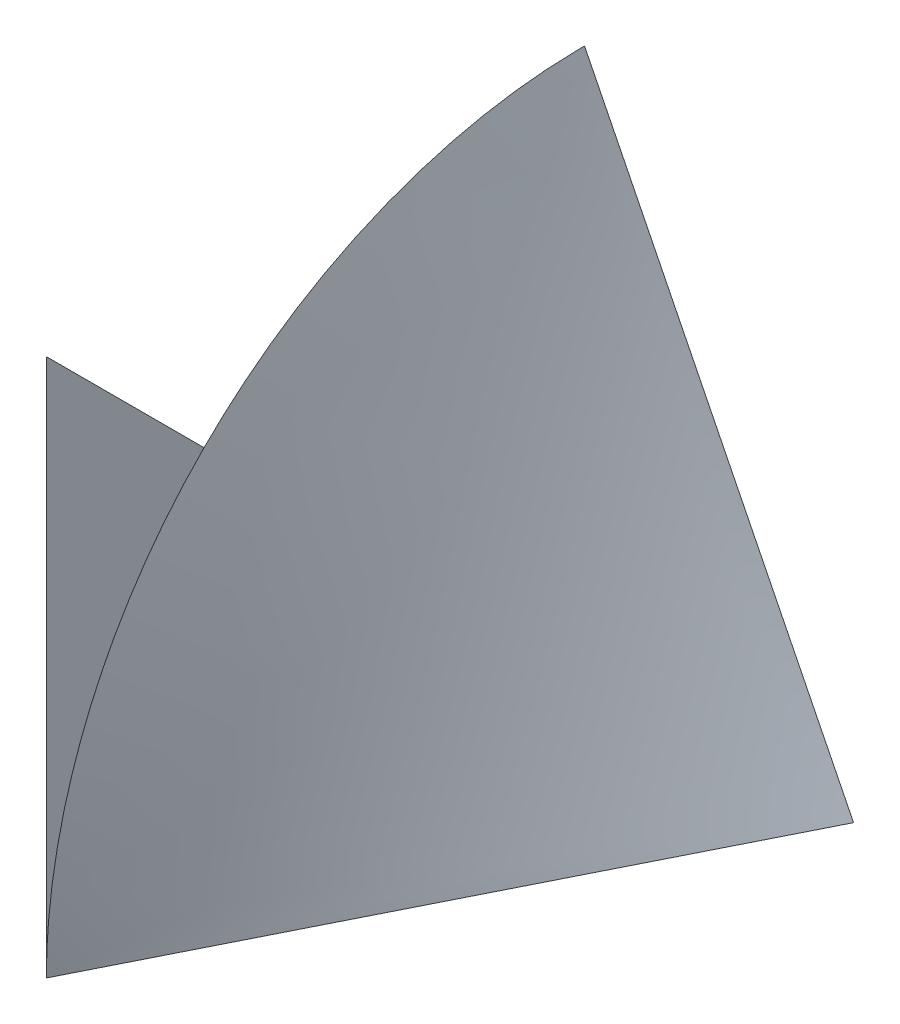
ISO-10303-21;
HEADER;
FILE_DESCRIPTION(('STEP AP214'),'2;1');
FILE_NAME('part.step','',(''),(''),'','','');
FILE_SCHEMA(('AUTOMOTIVE_DESIGN { 1 0 10303 214 1 1 1 1 }'));
ENDSEC;
DATA;
#1=APPLICATION_CONTEXT('core data for automotive mechanical design processes');
#2=APPLICATION_PROTOCOL_DEFINITION('international standard','automotive_design',2000,#1);
#3=PRODUCT_CONTEXT('',#1,'mechanical');
#4=PRODUCT('Part','Part','',(#3));
#5=PRODUCT_RELATED_PRODUCT_CATEGORY('part','',(#4));
#6=PRODUCT_DEFINITION_FORMATION('','',#4);
#7=PRODUCT_DEFINITION_CONTEXT('part definition',#1,'design');
#8=PRODUCT_DEFINITION('design','',#6,#7);
#9=PRODUCT_DEFINITION_SHAPE('','',#8);
#10=(LENGTH_UNIT() NAMED_UNIT(*) SI_UNIT(.MILLI.,.METRE.));
#11=(NAMED_UNIT(*) PLANE_ANGLE_UNIT() SI_UNIT($,.RADIAN.));
#12=(NAMED_UNIT(*) SI_UNIT($,.STERADIAN.) SOLID_ANGLE_UNIT());
#13=UNCERTAINTY_MEASURE_WITH_UNIT(LENGTH_MEASURE(1.E-05),#10,'distance_accuracy_value','');
#14=(GEOMETRIC_REPRESENTATION_CONTEXT(3) GLOBAL_UNCERTAINTY_ASSIGNED_CONTEXT((#13)) GLOBAL_UNIT_ASSIGNED_CONTEXT((#10,
#11,#12)) REPRESENTATION_CONTEXT('',''));
#15=CARTESIAN_POINT('',(0.,0.,0.));
#16=DIRECTION('',(0.,0.,1.));
#17=DIRECTION('',(1.,0.,0.));
#18=AXIS2_PLACEMENT_3D('',#15,#16,#17);
#19=CARTESIAN_POINT('',(0.,0.,0.));
#20=DIRECTION('',(0.,-1.,0.));
#21=DIRECTION('',(0.,0.,-1.));
#22=AXIS2_PLACEMENT_3D('',#19,#20,#21);
#23=PLANE('',#22);
#24=DIRECTION('',(0.447188418671129,0.,0.894439778971405));
#25=VECTOR('',#24,1.);
#26=CARTESIAN_POINT('',(-1.39406305274967E-05,0.,2.));
#27=LINE('',#26,#25);
#28=CARTESIAN_POINT('',(-1.99987335916185,-9.28745872898386E-06,-2.00000031664622));
#29=VERTEX_POINT('',#28);
#30=CARTESIAN_POINT('',(-3.56157288495491E-05,6.97657941034187E-05,2.00006976573752));
#31=VERTEX_POINT('',#30);
#32=EDGE_CURVE('E208',#29,#31,#27,.T.);
#33=ORIENTED_EDGE('',*,*,#32,.F.);
#34=CARTESIAN_POINT('',(0.000103609245025085,0.,-1.99999102927233));
#35=DIRECTION('',(-1.,0.,0.));
#36=VECTOR('',#35,1.);
#37=LINE('',#34,#36);
#38=CARTESIAN_POINT('',(0.000103609245025085,-5.22420083752249E-06,-1.99999625342544));
#39=VERTEX_POINT('',#38);
#40=EDGE_CURVE('E111',#39,#29,#37,.T.);
#41=ORIENTED_EDGE('',*,*,#40,.F.);
#42=DIRECTION('',(-1.,0.,0.));
#43=VECTOR('',#42,1.);
#44=CARTESIAN_POINT('',(-2.,0.,-2.));
#45=LINE('',#44,#43);
#46=CARTESIAN_POINT('',(1.99989168434998,-8.3713605003607E-06,-2.0000083713605));
#47=VERTEX_POINT('',#46);
#48=EDGE_CURVE('E59',#47,#39,#45,.T.);
#49=ORIENTED_EDGE('',*,*,#48,.F.);
#50=CARTESIAN_POINT('',(0.000875798366615509,0.000279063176195504,2.00027906272354));
#51=CARTESIAN_POINT('',(0.0837069902664033,0.000114321391326568,1.83341790211676));
#52=CARTESIAN_POINT('',(0.166760266654798,2.5824815957855E-05,1.66666738616965));
#53=CARTESIAN_POINT('',(0.333150650163644,-6.07299361798723E-05,1.33325678604981));
#54=CARTESIAN_POINT('',(0.416487821975475,-5.87658988175555E-05,1.16659673413993));
#55=CARTESIAN_POINT('',(0.5832516993621,-2.6430144579629E-05,0.833304277000826));
#56=CARTESIAN_POINT('',(0.66667841177579,3.94392325566219E-06,0.666671875201032));
#57=CARTESIAN_POINT('',(0.833462796655206,4.21516981306896E-05,0.333381132018225));
#58=CARTESIAN_POINT('',(0.91682047184071,4.99863399270686E-05,0.166722791997599));
#59=CARTESIAN_POINT('',(1.08344561174981,3.64771559339593E-05,-0.166625790121181));
#60=CARTESIAN_POINT('',(1.16671308184419,1.51351750872063E-05,-0.333316029535826));
#61=CARTESIAN_POINT('',(1.33324950456927,-2.7255169058637E-05,-0.666697336870446));
#62=CARTESIAN_POINT('',(1.41651845720639,-4.83035301613499E-05,-0.833388404787299));
#63=CARTESIAN_POINT('',(1.58319168850622,-4.59503601463192E-05,-1.16671774407098));
#64=CARTESIAN_POINT('',(1.66659597640317,-2.25456564726301E-05,-1.33335601082054));
#65=CARTESIAN_POINT('',(1.8333375242331,2.90581819594307E-06,-1.66665390369432));
#66=CARTESIAN_POINT('',(1.91667478779334,4.95383540343697E-06,-1.83331352800475));
#67=CARTESIAN_POINT('',(1.99988521040192,-3.65764076934509E-05,-2.00003657640769));
#68=B_SPLINE_CURVE_WITH_KNOTS('',3,(#50,#51,#52,#53,#54,#55,#56,#57,#58,#59,#60,#61,#62,#63,#64,
#65,#66,#67),.UNSPECIFIED.,.F.,.F.,(4,2,2,2,2,2,2,2,4),(0.,0.558866956671007,1.117871153294,
1.67692161219078,2.23594888577383,2.79494081168776,3.35393691681514,3.91297291824808,
4.47197629844018),.UNSPECIFIED.);
#69=EDGE_CURVE('E67',#47,#31,#68,.F.);
#70=ORIENTED_EDGE('',*,*,#69,.T.);
#71=EDGE_LOOP('',(#33,#41,#49,#70));
#72=FACE_BOUND('',#71,.T.);
#73=ADVANCED_FACE('F47',(#72),#23,.T.);
#74=CARTESIAN_POINT('',(0.000103609245025085,-9.28745872898386E-06,-2.00000031664622));
#75=DIRECTION('',(0.,-0.707103551547574,0.70711001081077));
#76=DIRECTION('',(0.,-0.70711001081077,-0.707103551547574));
#77=AXIS2_PLACEMENT_3D('',#74,#75,#76);
#78=PLANE('',#77);
#79=ORIENTED_EDGE('',*,*,#40,.T.);
#80=DIRECTION('',(0.333311129509906,0.666675262358807,0.666669172456359));
#81=VECTOR('',#80,1.);
#82=CARTESIAN_POINT('',(-1.7776832997765,0.444406164110659,-1.5555889246946));
#83=LINE('',#82,#81);
#84=CARTESIAN_POINT('',(-1.39406305274967E-05,4.00002756846773,2.));
#85=VERTEX_POINT('',#84);
#86=EDGE_CURVE('E12',#29,#85,#83,.T.);
#87=ORIENTED_EDGE('',*,*,#86,.T.);
#88=DIRECTION('',(0.,-0.70711001081077,-0.707103551547574));
#89=VECTOR('',#88,1.);
#90=CARTESIAN_POINT('',(-1.39406305274967E-05,1.99999087078094,-1.84278797841879E-05));
#91=LINE('',#90,#89);
#92=CARTESIAN_POINT('',(-0.000102407863481279,2.82818444233477,0.828167515466161));
#93=VERTEX_POINT('',#92);
#94=EDGE_CURVE('E105',#85,#93,#91,.T.);
#95=ORIENTED_EDGE('',*,*,#94,.T.);
#96=DIRECTION('',(0.,0.70711001081077,0.707103551547574));
#97=VECTOR('',#96,1.);
#98=CARTESIAN_POINT('',(0.000103609245025085,-9.28745872898386E-06,-2.00000031664622));
#99=LINE('',#98,#97);
#100=EDGE_CURVE('E92',#39,#93,#99,.T.);
#101=ORIENTED_EDGE('',*,*,#100,.F.);
#102=EDGE_LOOP('',(#79,#87,#95,#101));
#103=FACE_BOUND('',#102,.T.);
#104=ADVANCED_FACE('F106',(#103),#78,.F.);
#105=CARTESIAN_POINT('',(-2.,4.,-2.));
#106=DIRECTION('',(0.,0.,1.));
#107=DIRECTION('',(1.,0.,0.));
#108=AXIS2_PLACEMENT_3D('',#105,#106,#107);
#109=PLANE('',#108);
#110=ORIENTED_EDGE('',*,*,#48,.T.);
#111=DIRECTION('',(0.,-0.999999999999997,-7.91608245531659E-08));
#112=VECTOR('',#111,1.);
#113=CARTESIAN_POINT('',(0.000103609245025085,4.00002756846773,-2.));
#114=LINE('',#113,#112);
#115=CARTESIAN_POINT('',(-1.39406305274967E-05,4.00002756846773,-1.99997243153227));
#116=VERTEX_POINT('',#115);
#117=EDGE_CURVE('E115',#116,#39,#114,.T.);
#118=ORIENTED_EDGE('',*,*,#117,.F.);
#119=CARTESIAN_POINT('',(1.99988521040192,-3.65764076902739E-05,-2.00003657640769));
#120=CARTESIAN_POINT('',(1.91654485122619,0.166627903865693,-2.00003880792397));
#121=CARTESIAN_POINT('',(1.83320103399918,0.333290657306252,-2.0000422271948));
#122=CARTESIAN_POINT('',(1.66652639514234,0.666620305131661,-2.00004492483027));
#123=CARTESIAN_POINT('',(1.58319557337616,0.833287199448332,-2.00004420324175));
#124=CARTESIAN_POINT('',(1.41656681786021,1.16663275869716,-2.0000321032242));
#125=CARTESIAN_POINT('',(1.33326888341521,1.33331142328179,-2.000020725034));
#126=CARTESIAN_POINT('',(1.16668077614414,1.66667133956219,-1.99999547984068));
#127=CARTESIAN_POINT('',(1.0833906032732,1.83335259123553,-1.99998161285297));
#128=CARTESIAN_POINT('',(0.916788519100106,2.16670770044612,-1.99996086981952));
#129=CARTESIAN_POINT('',(0.833476607459166,2.3333815578141,-1.99995399389016));
#130=CARTESIAN_POINT('',(0.666818288562755,2.66671732680947,-1.99995136478653));
#131=CARTESIAN_POINT('',(0.583471880483026,2.83337923802468,-1.99995561189546));
#132=CARTESIAN_POINT('',(0.416766179249375,3.16669651780215,-1.99996854669685));
#133=CARTESIAN_POINT('',(0.333406886102092,3.33335188636771,-1.99997723438705));
#134=CARTESIAN_POINT('',(0.166782488533559,3.66669263770975,-1.99996459731462));
#135=CARTESIAN_POINT('',(0.0835173769603532,3.83337801691231,-1.99994327500886));
#136=CARTESIAN_POINT('',(0.000346078090228706,4.00011027387091,-1.99988972612908));
#137=B_SPLINE_CURVE_WITH_KNOTS('',3,(#119,#120,#121,#122,#123,#124,#125,#126,#127,#128,#129,
#130,#131,#132,#133,#134,#135,#136),.UNSPECIFIED.,.F.,.F.,(4,2,2,2,2,2,2,2,4),(0.,
0.559020558287219,1.11803479226773,1.67703649758111,2.23603474063693,2.79504228889593,
3.35406406956563,3.91308556318331,4.47206129348129),.UNSPECIFIED.);
#138=EDGE_CURVE('E194',#116,#47,#137,.F.);
#139=ORIENTED_EDGE('',*,*,#138,.T.);
#140=EDGE_LOOP('',(#110,#118,#139));
#141=FACE_BOUND('',#140,.T.);
#142=ADVANCED_FACE('F49',(#141),#109,.F.);
#143=CARTESIAN_POINT('',(-0.0223445822368762,4.04551000308371,-2.05013568896862));
#144=CARTESIAN_POINT('',(0.389245917586985,3.22979955401737,-2.04815105747686));
#145=CARTESIAN_POINT('',(0.80376631841207,2.41502268478151,-2.04523284615462));
#146=CARTESIAN_POINT('',(1.2138327944319,1.59882662275964,-2.0437338276184));
#147=CARTESIAN_POINT('',(1.62547477029438,0.783132575951057,-2.04173279386888));
#148=CARTESIAN_POINT('',(2.0363210381082,-0.0328150142314784,-2.03998530349331));
#149=CARTESIAN_POINT('',(-0.00157645550172039,4.01078979222863,-1.12088691832415));
#150=CARTESIAN_POINT('',(0.330782508042385,3.1698331098672,-1.14414852012748));
#151=CARTESIAN_POINT('',(0.661463515093786,2.32834176563927,-1.16794478379732));
#152=CARTESIAN_POINT('',(0.998024508618965,1.48872401262588,-1.1898674562526));
#153=CARTESIAN_POINT('',(1.3496576785027,0.65390883821288,-1.20698755010751));
#154=CARTESIAN_POINT('',(1.70166608078987,-0.180786772636899,-1.22398808039919));
#155=CARTESIAN_POINT('',(-0.0801410042412669,3.94441834732446,-0.223289381728774));
#156=CARTESIAN_POINT('',(0.212645880851122,3.09085246954069,-0.259160178954445));
#157=CARTESIAN_POINT('',(0.487497486294741,2.23157171766153,-0.3007458502755));
#158=CARTESIAN_POINT('',(0.76296722670346,1.37248792750071,-0.342134559878237));
#159=CARTESIAN_POINT('',(1.0370474490773,0.512961383127122,-0.383966023693716));
#160=CARTESIAN_POINT('',(1.33318970498991,-0.339535343678444,-0.418767669941185));
#161=CARTESIAN_POINT('',(-0.225399102421753,3.85679575688504,0.653057009331347));
#162=CARTESIAN_POINT('',(0.0687644817012423,3.00366854868332,0.617624881687722));
#163=CARTESIAN_POINT('',(0.316590909279943,2.13577652940659,0.567427942969095));
#164=CARTESIAN_POINT('',(0.464826169582532,1.23615091059074,0.485497404711355));
#165=CARTESIAN_POINT('',(0.713655116844502,0.368578332877242,0.435619907555955));
#166=CARTESIAN_POINT('',(0.961196515742705,-0.499404507566119,0.385332147670681));
#167=CARTESIAN_POINT('',(-0.42444655194897,3.75203379774657,1.51226403169242));
#168=CARTESIAN_POINT('',(-0.154207559267555,2.8912832889579,1.46920860346185));
#169=CARTESIAN_POINT('',(0.0680055397752079,2.01522987211099,1.41085026717304));
#170=CARTESIAN_POINT('',(0.208824710855955,1.11324120030595,1.32655667592612));
#171=CARTESIAN_POINT('',(0.366742160711515,0.216700701730546,1.2477112579088));
#172=CARTESIAN_POINT('',(0.522343418228537,-0.680577825348242,1.1681278113881));
#173=CARTESIAN_POINT('',(-0.662558095217739,3.6348245067707,2.35902372221611));
#174=CARTESIAN_POINT('',(-0.408614144013187,2.76888176723662,2.31077606324013));
#175=CARTESIAN_POINT('',(-0.203038330924701,1.88752706731073,2.24711644387233));
#176=CARTESIAN_POINT('',(-0.0425084820645144,0.991818980144022,2.16910343726371));
#177=CARTESIAN_POINT('',(-0.0322366133536195,0.048232886322163,2.04321242399998));
#178=CARTESIAN_POINT('',(0.0386648782400475,-0.876034263607353,1.93664035462853));
#179=B_SPLINE_SURFACE_WITH_KNOTS('',5,5,((#143,#144,#145,#146,#147,#148),(#149,#150,#151,#152,
#153,#154),(#155,#156,#157,#158,#159,#160),(#161,#162,#163,#164,#165,#166),(#167,#168,#169,#170,
#171,#172),(#173,#174,#175,#176,#177,#178)),.UNSPECIFIED.,.F.,.F.,.F.,(6,6),(6,6),
(-1.64494672878529,2.79186118228678),(-2.54970046226169,1.96558601863418),.UNSPECIFIED.);
#180=CARTESIAN_POINT('',(0.000346078090228502,4.00011027387092,-1.99988972612909));
#181=CARTESIAN_POINT('',(0.000340741411696202,4.00010857405014,-1.99897851564378));
#182=CARTESIAN_POINT('',(0.000335437691624804,4.00010657119289,-1.99806730553074));
#183=CARTESIAN_POINT('',(0.000324895936222993,4.00010195943391,-1.99624492105267));
#184=CARTESIAN_POINT('',(0.000319657898406586,4.0000993505552,-1.99533374668759));
#185=CARTESIAN_POINT('',(0.000309247068695348,4.00009352676374,-1.99351143426773));
#186=CARTESIAN_POINT('',(0.000304074274320183,4.00009031187411,-1.99260029621289));
#187=CARTESIAN_POINT('',(0.00029379349458493,4.00008327607177,-1.99077805697498));
#188=CARTESIAN_POINT('',(0.000288685506750293,4.00007945518227,-1.98986695579183));
#189=CARTESIAN_POINT('',(0.000278533904599104,4.00007120739162,-1.98804479085794));
#190=CARTESIAN_POINT('',(0.00027349028781393,4.00006678051379,-1.98713372710711));
#191=CARTESIAN_POINT('',(0.000263466993815141,4.00005732075837,-1.98531163759767));
#192=CARTESIAN_POINT('',(0.000258487314138966,4.00005228790421,-1.98440061183894));
#193=CARTESIAN_POINT('',(0.000248591461917345,4.00004161620854,-1.9825785988727));
#194=CARTESIAN_POINT('',(0.000243675286915538,4.00003597739054,-1.98166761166505));
#195=CARTESIAN_POINT('',(0.000233906013124367,4.00002409378007,-1.97984567635912));
#196=CARTESIAN_POINT('',(0.000229052911884976,4.00001784901121,-1.97893472826069));
#197=CARTESIAN_POINT('',(0.000219409356213384,4.00000475351239,-1.97711287173051));
#198=CARTESIAN_POINT('',(0.00021461889933762,3.99999790280614,-1.97620196329861));
#199=CARTESIAN_POINT('',(0.000205100204507336,3.99998359544635,-1.97438018665798));
#200=CARTESIAN_POINT('',(0.000200371964115848,3.99997613881663,-1.97346931844909));
#201=CARTESIAN_POINT('',(0.000190977275881993,3.99996061962424,-1.97164762281017));
#202=CARTESIAN_POINT('',(0.000186310825609382,3.99995255708549,-1.97073679537994));
#203=CARTESIAN_POINT('',(0.000177039292757789,3.99993582608984,-1.96891518185321));
#204=CARTESIAN_POINT('',(0.000172434207755413,3.99992715765696,-1.96800439575649));
#205=CARTESIAN_POINT('',(0.000163284982099039,3.99990921488834,-1.96618286545078));
#206=CARTESIAN_POINT('',(0.000158740839028621,3.99989994057671,-1.96527212124157));
#207=CARTESIAN_POINT('',(0.000149713075430851,3.99988078606639,-1.96345067526409));
#208=CARTESIAN_POINT('',(0.000145229452494175,3.99987090589189,-1.96253997349557));
#209=CARTESIAN_POINT('',(0.000136322308768512,3.99985053967208,-1.96071861295185));
#210=CARTESIAN_POINT('',(0.000131898785577424,3.99984005365108,-1.95980795417639));
#211=CARTESIAN_POINT('',(0.000123111422852146,3.99981847575501,-1.95798668017033));
#212=CARTESIAN_POINT('',(0.000118747580923181,3.99980738390434,-1.95707606493946));
#213=CARTESIAN_POINT('',(0.000114413284051044,3.99979598890504,-1.95616545336141));
#214=B_SPLINE_CURVE_WITH_KNOTS('',3,(#180,#181,#182,#183,#184,#185,#186,#187,#188,#189,#190,
#191,#192,#193,#194,#195,#196,#197,#198,#199,#200,#201,#202,#203,#204,#205,#206,#207,#208,#209,
#210,#211,#212,#213),.UNSPECIFIED.,.F.,.F.,(4,2,2,2,2,2,2,2,2,2,2,2,2,2,2,2,4),(0.,
0.00273368304377199,0.00546726230673018,0.00820073733311294,0.0109341076694122,
0.0136673728643797,0.0164005324690386,0.0191335860366666,0.0218665331228122,0.0245993732852783,
0.0273321060841429,0.0300647310817479,0.0327972478426922,0.0355296559338529,0.0382619549243627,
0.0409941443856234,0.0437262238913072),.UNSPECIFIED.);
#215=CARTESIAN_POINT('',(0.000103609245025085,4.00002756846773,-1.96047909161518));
#216=VERTEX_POINT('',#215);
#217=EDGE_CURVE('E122',#216,#116,#214,.F.);
#218=CARTESIAN_POINT('',(0.000114413284051044,3.99979598890504,-1.95616545336141));
#219=CARTESIAN_POINT('',(-4.25894540195342E-05,3.99938212161447,-1.92308708573734));
#220=CARTESIAN_POINT('',(-0.000161477371957222,3.99856812212523,-1.89001349731456));
#221=CARTESIAN_POINT('',(-0.00033932730782364,3.99613948136541,-1.82395027436099));
#222=CARTESIAN_POINT('',(-0.000398387969879696,3.99452616458521,-1.79096059138731));
#223=CARTESIAN_POINT('',(-0.000473229590477698,3.99050078486364,-1.72508952898664));
#224=CARTESIAN_POINT('',(-0.000489088269026058,3.98809016504002,-1.69220806150177));
#225=CARTESIAN_POINT('',(-0.000491019976418901,3.98247303593408,-1.62657648056109));
#226=CARTESIAN_POINT('',(-0.000477149889929232,3.97926805700131,-1.59382623616404));
#227=CARTESIAN_POINT('',(-0.000430925866850361,3.97206588742445,-1.52847887210078));
#228=CARTESIAN_POINT('',(-0.000398608736140329,3.9680702845882,-1.49588157744989));
#229=CARTESIAN_POINT('',(-0.000324529275513277,3.95929136526169,-1.43086068543684));
#230=CARTESIAN_POINT('',(-0.000282786276257052,3.95450966628782,-1.39843686969709));
#231=CARTESIAN_POINT('',(-0.000196867828615135,3.94416382401855,-1.33378238539011));
#232=CARTESIAN_POINT('',(-0.000152697535712132,3.9386013028381,-1.30155145728192));
#233=CARTESIAN_POINT('',(-6.70926006408974E-05,3.92669981172109,-1.23730116116101));
#234=CARTESIAN_POINT('',(-2.56525694881727E-05,3.92036244641117,-1.20528149594647));
#235=CARTESIAN_POINT('',(5.09522604794632E-05,3.90691793600892,-1.14147119121927));
#236=CARTESIAN_POINT('',(8.61294703860521E-05,3.89981235926004,-1.10968022129846));
#237=CARTESIAN_POINT('',(0.000148077279488402,3.88483871309769,-1.04634391875682));
#238=CARTESIAN_POINT('',(0.000174864167122915,3.87697216036471,-1.01479822759764));
#239=CARTESIAN_POINT('',(0.000219081796083288,3.86048441053558,-0.951968335251022));
#240=CARTESIAN_POINT('',(0.00023653010916557,3.85186466648895,-0.920683752772903));
#241=CARTESIAN_POINT('',(0.000262077198921673,3.83387888676476,-0.858391266949275));
#242=CARTESIAN_POINT('',(0.000270192861618179,3.82451423183262,-0.827382964944906));
#243=CARTESIAN_POINT('',(0.000277816588299973,3.80504743252861,-0.765657659908827));
#244=CARTESIAN_POINT('',(0.000277339507652542,3.79494659100998,-0.73494024598111));
#245=CARTESIAN_POINT('',(0.00026904381282674,3.77401661836242,-0.673810859196576));
#246=CARTESIAN_POINT('',(0.000261237245980024,3.76318870941095,-0.643398467868583));
#247=CARTESIAN_POINT('',(0.000239875174498701,3.74081415274137,-0.582892877897003));
#248=CARTESIAN_POINT('',(0.000226328608173777,3.72926864621626,-0.552799257231621));
#249=CARTESIAN_POINT('',(0.000195226666395811,3.70546875380519,-0.492944652444075));
#250=CARTESIAN_POINT('',(0.000177677186028949,3.69321542994222,-0.463183246013379));
#251=CARTESIAN_POINT('',(0.000140296504477946,3.66801004238711,-0.404006278656172));
#252=CARTESIAN_POINT('',(0.000120468481749293,3.65505896511526,-0.37459029756388));
#253=CARTESIAN_POINT('',(8.0119663829511E-05,3.62846844462537,-0.316117232344778));
#254=CARTESIAN_POINT('',(5.95998017835635E-05,3.61482991723099,-0.287059731732412));
#255=CARTESIAN_POINT('',(1.91789137988373E-05,3.58687516202718,-0.22931654332962));
#256=CARTESIAN_POINT('',(-7.22839850573625E-07,3.57255978540368,-0.200630443446071));
#257=CARTESIAN_POINT('',(-3.88257490781719E-05,3.54326186652831,-0.143642786005401));
#258=CARTESIAN_POINT('',(-5.70288380938132E-05,3.52828011217089,-0.115340823378671));
#259=CARTESIAN_POINT('',(-9.06778284340726E-05,3.49765905642126,-0.0591340362820809));
#260=CARTESIAN_POINT('',(-0.00010612665132354,3.48202047378205,-0.0312288202414955));
#261=CARTESIAN_POINT('',(-0.000133654088482932,3.45009549393264,0.0241721033054447));
#262=CARTESIAN_POINT('',(-0.000145735992921417,3.43380974704716,0.0516681855638208));
#263=CARTESIAN_POINT('',(-0.000166296376272344,3.40060016527128,0.1062385703382));
#264=CARTESIAN_POINT('',(-0.000174778069062666,3.38367691423363,0.13331322816495));
#265=CARTESIAN_POINT('',(-0.000188271627478336,3.34920208494546,0.187028605828232));
#266=CARTESIAN_POINT('',(-0.000193286293301164,3.33165102583308,0.213669658849303));
#267=CARTESIAN_POINT('',(-0.000200291183400489,3.29593037574587,0.266505780657874));
#268=CARTESIAN_POINT('',(-0.000202283590010554,3.27776124077774,0.292701157734126));
#269=CARTESIAN_POINT('',(-0.000203933536072325,3.24081428752331,0.344634004136789));
#270=CARTESIAN_POINT('',(-0.00020359255902224,3.22203686352708,0.370371753974381));
#271=CARTESIAN_POINT('',(-0.000201427370822704,3.18388325318919,0.421377558339216));
#272=CARTESIAN_POINT('',(-0.000199603972852473,3.16450740071866,0.446645862609059));
#273=CARTESIAN_POINT('',(-0.000195397220208805,3.12516695033214,0.496701141341494));
#274=CARTESIAN_POINT('',(-0.000193014123296802,3.10520262711813,0.521488331702242));
#275=CARTESIAN_POINT('',(-0.000188592527475895,3.06469536863711,0.570569915762271));
#276=CARTESIAN_POINT('',(-0.000186553901392654,3.0441526501885,0.594864488402012));
#277=CARTESIAN_POINT('',(-0.000183610847307622,3.00249888298307,0.642949563286441));
#278=CARTESIAN_POINT('',(-0.000182706102688674,2.98138799456067,0.666740204420496));
#279=CARTESIAN_POINT('',(-0.000182653130464137,2.93860829988762,0.713806313688577));
#280=CARTESIAN_POINT('',(-0.000183504573240215,2.91693959908643,0.737081877668552));
#281=CARTESIAN_POINT('',(-0.000187251182118985,2.87305497379709,0.783107040820334));
#282=CARTESIAN_POINT('',(-0.000190146153301199,2.8508391016955,0.805856689942428));
#283=CARTESIAN_POINT('',(-0.000194206863951416,2.82835482454806,0.82833790313367));
#284=B_SPLINE_CURVE_WITH_KNOTS('',3,(#218,#219,#220,#221,#222,#223,#224,#225,#226,#227,#228,
#229,#230,#231,#232,#233,#234,#235,#236,#237,#238,#239,#240,#241,#242,#243,#244,#245,#246,#247,
#248,#249,#250,#251,#252,#253,#254,#255,#256,#257,#258,#259,#260,#261,#262,#263,#264,#265,#266,
#267,#268,#269,#270,#271,#272,#273,#274,#275,#276,#277,#278,#279,#280,#281,#282,#283),
.UNSPECIFIED.,.F.,.F.,(4,2,2,2,2,2,2,2,2,2,2,2,2,2,2,2,2,2,2,2,2,2,2,2,2,2,2,2,2,2,2,2,4),(0.,
0.099241615683216,0.198319332563582,0.297218691387008,0.395928979660194,0.494443004360295,
0.592756801470376,0.690869299353287,0.788781951952211,0.886498356343734,0.984023867406377,
1.08136522042757,1.17853017046068,1.27552715524691,1.37236498660078,1.46905257336975,
1.56559867745002,1.66201170288855,1.75829951683316,1.85446930554805,1.95052826248668,
2.04648471145757,2.14234705986864,2.2381236518926,2.33382279783206,2.4294528077283,
2.52502202446616,2.62053885223269,2.71601177703434,2.81144937704279,2.90686032177919,
3.002253360491,3.09763730143612),.UNSPECIFIED.);
#285=EDGE_CURVE('E77',#216,#93,#284,.T.);
#286=CARTESIAN_POINT('',(-0.000194206863951416,2.82835482454806,0.82833790313367));
#287=CARTESIAN_POINT('',(-0.000196848917209324,2.81346448026695,0.84322633868117));
#288=CARTESIAN_POINT('',(-0.000199977389013982,2.79845645385192,0.857997074408502));
#289=CARTESIAN_POINT('',(-0.000207093787265926,2.76820829215276,0.887300127900097));
#290=CARTESIAN_POINT('',(-0.000211081747132174,2.75296814786474,0.901832436370083));
#291=CARTESIAN_POINT('',(-0.000219803862683714,2.72225894360658,0.930655604436793));
#292=CARTESIAN_POINT('',(-0.000224538077681941,2.70678986552924,0.944946444741391));
#293=CARTESIAN_POINT('',(-0.000234561426424951,2.6756260391976,0.973283702153148));
#294=CARTESIAN_POINT('',(-0.000239850626720125,2.65993126407428,0.987330089711062));
#295=CARTESIAN_POINT('',(-0.000250740031790142,2.62831931524612,1.01517549456579));
#296=CARTESIAN_POINT('',(-0.000256340286326734,2.61240210626342,1.02897447181267));
#297=CARTESIAN_POINT('',(-0.000267555658199913,2.58034859110208,1.05632213981202));
#298=CARTESIAN_POINT('',(-0.000273170778293497,2.56421224159831,1.06987077978399));
#299=CARTESIAN_POINT('',(-0.000284077255164194,2.53172377138385,1.09671488170717));
#300=CARTESIAN_POINT('',(-0.000289368533674259,2.51537159966434,1.110010281924));
#301=CARTESIAN_POINT('',(-0.000299255997765101,2.48245483212412,1.13634503333584));
#302=CARTESIAN_POINT('',(-0.000303851987838366,2.46589017797081,1.14938431161861));
#303=CARTESIAN_POINT('',(-0.000311956608907302,2.43255180877014,1.17520396280047));
#304=CARTESIAN_POINT('',(-0.000315464890909891,2.41577802841622,1.1879842513755));
#305=CARTESIAN_POINT('',(-0.000320994877267643,2.38202478231595,1.21328307719161));
#306=CARTESIAN_POINT('',(-0.000323016045436275,2.36504524462345,1.22580151844329));
#307=CARTESIAN_POINT('',(-0.000325177354531388,2.33088377925184,1.25057386210186));
#308=CARTESIAN_POINT('',(-0.000325316732938745,2.31370177235263,1.26282765526298));
#309=CARTESIAN_POINT('',(-0.000323333388064048,2.27913837324572,1.28706808015505));
#310=CARTESIAN_POINT('',(-0.000321209610186265,2.26175689182109,1.29905458467532));
#311=CARTESIAN_POINT('',(-0.000314382505453276,2.22679760033045,1.32275781246687));
#312=CARTESIAN_POINT('',(-0.00030967782298434,2.20921969184893,1.3344743905871));
#313=CARTESIAN_POINT('',(-0.000297444872796844,2.17387072054143,1.35763508103952));
#314=CARTESIAN_POINT('',(-0.000289914970345534,2.15609955168276,1.36907903153854));
#315=CARTESIAN_POINT('',(-0.000271873989960718,2.12036734230909,1.39169172019627));
#316=CARTESIAN_POINT('',(-0.000261361042815956,2.1024061895632,1.40286028100804));
#317=CARTESIAN_POINT('',(-0.000237294080791705,2.06629739292576,1.42491938273652));
#318=CARTESIAN_POINT('',(-0.000223738027810702,2.04814963186328,1.43580973185277));
#319=CARTESIAN_POINT('',(-0.000193632804457542,2.01167108722143,1.45730954362449));
#320=CARTESIAN_POINT('',(-0.0001770815118205,1.99334018263366,1.4679188009636));
#321=CARTESIAN_POINT('',(-0.000141149779508717,1.95649889847274,1.48885350607277));
#322=CARTESIAN_POINT('',(-0.000121767234727304,1.93798839500799,1.49917873581342));
#323=CARTESIAN_POINT('',(-8.04587539134847E-05,1.90079153111394,1.51954240936764));
#324=CARTESIAN_POINT('',(-5.85308449290677E-05,1.8821050447254,1.52958062309794));
#325=CARTESIAN_POINT('',(-1.25419925420879E-05,1.84455989600508,1.54936723925378));
#326=CARTESIAN_POINT('',(1.15206662446596E-05,1.8257011063348,1.5591154000523));
#327=CARTESIAN_POINT('',(6.12446738013101E-05,1.78781508867148,1.57831884127923));
#328=CARTESIAN_POINT('',(8.69073480567844E-05,1.76878773253523,1.58777386889623));
#329=CARTESIAN_POINT('',(0.000139177542867586,1.73056837098264,1.60638793757571));
#330=CARTESIAN_POINT('',(0.000165785863478988,1.71137623709395,1.61554671485347));
#331=CARTESIAN_POINT('',(0.000219182761972341,1.67283115667196,1.63356514747806));
#332=CARTESIAN_POINT('',(0.000245971479718339,1.65347808172991,1.64242452813652));
#333=CARTESIAN_POINT('',(0.000298867184350015,1.61461500105008,1.65984101233941));
#334=CARTESIAN_POINT('',(0.000324973521234825,1.59510486729409,1.6683978302317));
#335=CARTESIAN_POINT('',(0.000375563267418658,1.5559315951979,1.68520602483218));
#336=CARTESIAN_POINT('',(0.000400045117106946,1.53626832950878,1.69345710475108));
#337=CARTESIAN_POINT('',(0.000446388686389613,1.49679276485085,1.70965066295088));
#338=CARTESIAN_POINT('',(0.000468247832512513,1.47698033945076,1.71759283304044));
#339=CARTESIAN_POINT('',(0.000508321077837565,1.43721047410302,1.73316542885019));
#340=CARTESIAN_POINT('',(0.000526531507473802,1.41725290887727,1.74079553464759));
#341=CARTESIAN_POINT('',(0.000558288047383727,1.37719683396968,1.75574089256225));
#342=CARTESIAN_POINT('',(0.000571829339468278,1.35709820040228,1.76305581266363));
#343=CARTESIAN_POINT('',(0.000593272278764635,1.31676411575135,1.77736774054191));
#344=CARTESIAN_POINT('',(0.000601167945328998,1.29652854243344,1.78436440385331));
#345=CARTESIAN_POINT('',(0.000610431273565557,1.25592476904415,1.79803682889066));
#346=CARTESIAN_POINT('',(0.00061179182728935,1.23555644868096,1.80471223339204));
#347=CARTESIAN_POINT('',(0.0006072309381087,1.19469144414055,1.81773924100894));
#348=CARTESIAN_POINT('',(0.000601301355537536,1.17419464194904,1.82409047392448));
#349=CARTESIAN_POINT('',(0.000581591921139946,1.13307701846524,1.83646634932869));
#350=CARTESIAN_POINT('',(0.000567803066086159,1.11245608182232,1.8424906085677));
#351=CARTESIAN_POINT('',(0.0005320473043015,1.07109462659235,1.85420988067257));
#352=CARTESIAN_POINT('',(0.000510070783694497,1.05035399575951,1.8599044973574));
#353=CARTESIAN_POINT('',(0.00045790994379861,1.00875769330195,1.87096198472028));
#354=CARTESIAN_POINT('',(0.000427715748832119,0.987901913031954,1.87632444664738));
#355=CARTESIAN_POINT('',(0.000359447534163644,0.946079969030852,1.8867153048712));
#356=CARTESIAN_POINT('',(0.000321363830772719,0.925113700799826,1.89174328049986));
#357=CARTESIAN_POINT('',(0.000238063049054137,0.883075567055995,1.90146305110015));
#358=CARTESIAN_POINT('',(0.000192837042602632,0.862003601772664,1.90615441447529));
#359=CARTESIAN_POINT('',(9.64786244402261E-05,0.819759001451199,1.91519907288324));
#360=CARTESIAN_POINT('',(4.53387141908795E-05,0.798586271979816,1.91955192675025));
#361=CARTESIAN_POINT('',(-6.10815852951407E-05,0.756145225658518,1.92791793563106));
#362=CARTESIAN_POINT('',(-0.000116367270776205,0.734876820326436,1.93193064167581));
#363=CARTESIAN_POINT('',(-0.000228705405192462,0.692249668263562,1.93961498375391));
#364=CARTESIAN_POINT('',(-0.000285760078009271,0.670890839592668,1.9432861651677));
#365=CARTESIAN_POINT('',(-0.000398632336304434,0.628088256997184,1.95028645209304));
#366=CARTESIAN_POINT('',(-0.000454448189634639,0.606644428191391,1.9536150997233));
#367=CARTESIAN_POINT('',(-0.000561028707997629,0.563674482168636,1.95992981889768));
#368=CARTESIAN_POINT('',(-0.000611785899430594,0.542148290596462,1.96291538454425));
#369=CARTESIAN_POINT('',(-0.000703577235421051,0.499013293890575,1.96854379029661));
#370=CARTESIAN_POINT('',(-0.000744594422244658,0.477404410273553,1.97118602908844));
#371=CARTESIAN_POINT('',(-0.000811666783286814,0.434109375431952,1.97612759867595));
#372=CARTESIAN_POINT('',(-0.000837695804278224,0.412423155185458,1.97842632492532));
#373=CARTESIAN_POINT('',(-0.000868648926160394,0.368983779348466,1.98268046435229));
#374=CARTESIAN_POINT('',(-0.000873540883865597,0.347230572119918,1.98463535032401));
#375=CARTESIAN_POINT('',(-0.000855046359094492,0.303670652160761,1.98820147098725));
#376=CARTESIAN_POINT('',(-0.00083162710220967,0.281863906638694,1.98981230484559));
#377=CARTESIAN_POINT('',(-0.000748195983404494,0.238211510001367,1.99269024819134));
#378=CARTESIAN_POINT('',(-0.00068815688260384,0.216365842006417,1.99395710080104));
#379=CARTESIAN_POINT('',(-0.000522113291427635,0.172649418912309,1.99614743207125));
#380=CARTESIAN_POINT('',(-0.000416091899524075,0.150778657540625,1.99707078424059));
#381=CARTESIAN_POINT('',(-0.00014740505783984,0.107023114999426,1.99857515443694));
#382=CARTESIAN_POINT('',(1.5267108180111E-05,0.0851383324748358,1.99915613185167));
#383=CARTESIAN_POINT('',(0.000211591685028632,0.0632506542382248,1.99956666046948));
#384=B_SPLINE_CURVE_WITH_KNOTS('',3,(#286,#287,#288,#289,#290,#291,#292,#293,#294,#295,#296,
#297,#298,#299,#300,#301,#302,#303,#304,#305,#306,#307,#308,#309,#310,#311,#312,#313,#314,#315,
#316,#317,#318,#319,#320,#321,#322,#323,#324,#325,#326,#327,#328,#329,#330,#331,#332,#333,#334,
#335,#336,#337,#338,#339,#340,#341,#342,#343,#344,#345,#346,#347,#348,#349,#350,#351,#352,#353,
#354,#355,#356,#357,#358,#359,#360,#361,#362,#363,#364,#365,#366,#367,#368,#369,#370,#371,#372,
#373,#374,#375,#376,#377,#378,#379,#380,#381,#382,#383),.UNSPECIFIED.,.F.,.F.,(4,2,2,2,2,2,2,2,
2,2,2,2,2,2,2,2,2,2,2,2,2,2,2,2,2,2,2,2,2,2,2,2,2,2,2,2,2,2,2,2,2,2,2,2,2,2,2,2,4),(0.,
0.0631696720110609,0.126341800654083,0.189518952800666,0.252703689435642,0.315898563499031,
0.379106118837954,0.442328890538876,0.505569406880417,0.568830193106423,0.632113777171507,
0.695423003577986,0.758761744007793,0.822133784851484,0.885542550805353,0.948991137522435,
1.01248234599977,1.07601871831734,1.13960257427226,1.20323604838438,1.26692112668704,
1.33065968266099,1.39445351162152,1.45830436282959,1.52221396856912,1.58618406941634,
1.65021643492573,1.71431287897208,1.7784752690243,1.84270552868523,1.90700563291679,
1.97137759548418,2.03582344829903,2.1003452125199,2.16494486148136,2.22962427576687,
2.29438519101415,2.35922913933877,2.4241573855754,2.48917085985718,2.55427014165549,
2.61946421729304,2.68477097956964,2.75019135460673,2.81571117963734,2.88130692622265,
2.94695152439198,3.0126202717616,3.07829680714925),.UNSPECIFIED.);
#385=CARTESIAN_POINT('',(-1.39406305274967E-05,0.0636424465234386,2.));
#386=VERTEX_POINT('',#385);
#387=EDGE_CURVE('E120',#386,#93,#384,.F.);
#388=CARTESIAN_POINT('',(0.000211591685028632,0.0632506542382248,1.99956666046948));
#389=CARTESIAN_POINT('',(0.000223367217398455,0.0619389329255487,1.99959126689113));
#390=CARTESIAN_POINT('',(0.000235264746106753,0.0606272012330377,1.99961526160178));
#391=CARTESIAN_POINT('',(0.000259306385956399,0.0580037128909408,1.99966202818727));
#392=CARTESIAN_POINT('',(0.000271450498115683,0.0566919562412743,1.99968480005707));
#393=CARTESIAN_POINT('',(0.000295987853804129,0.0540684185913993,1.99972912144567));
#394=CARTESIAN_POINT('',(0.000308381098477927,0.0527566375911067,1.99975067095887));
#395=CARTESIAN_POINT('',(0.000333419279746431,0.0501330517561858,1.99979254813255));
#396=CARTESIAN_POINT('',(0.000346064217632293,0.0488212469214697,1.99981287578676));
#397=CARTESIAN_POINT('',(0.000371608354529606,0.046197613841922,1.99985230975052));
#398=CARTESIAN_POINT('',(0.000384507554999376,0.0448857855969992,1.99987141605306));
#399=CARTESIAN_POINT('',(0.000410562795523721,0.0422621060277386,1.99990840783241));
#400=CARTESIAN_POINT('',(0.000423718837225282,0.0409502547033066,1.99992629330139));
#401=CARTESIAN_POINT('',(0.000450290347573345,0.0383265292106403,1.99996084394319));
#402=CARTESIAN_POINT('',(0.000463705818077876,0.0370146550423095,1.99997750910727));
#403=CARTESIAN_POINT('',(0.00049079878218785,0.0343908840008081,2.00000961967966));
#404=CARTESIAN_POINT('',(0.000504476277885622,0.0330789871275397,2.00002506507823));
#405=CARTESIAN_POINT('',(0.000532095897168163,0.0304551707169148,2.00005473667086));
#406=CARTESIAN_POINT('',(0.000546038023103718,0.0291432511794604,2.00006896285408));
#407=CARTESIAN_POINT('',(0.000574189516121576,0.0265193893814412,2.00009619657816));
#408=CARTESIAN_POINT('',(0.000588398885838192,0.0252074471207798,2.00010920410701));
#409=CARTESIAN_POINT('',(0.000617087487993597,0.0225835397159879,2.00013400109551));
#410=CARTESIAN_POINT('',(0.000631566723376223,0.021271574571764,2.00014579054187));
#411=CARTESIAN_POINT('',(0.000660797686601718,0.0186476211365877,2.00016815194964));
#412=CARTESIAN_POINT('',(0.000675549417724886,0.0173356328455469,2.00017872389638));
#413=CARTESIAN_POINT('',(0.000705328010146354,0.0147116327490157,2.00019865090019));
#414=CARTESIAN_POINT('',(0.000720354875089307,0.0133996209434442,2.00020800594112));
#415=CARTESIAN_POINT('',(0.000750686380780576,0.0107755733441006,2.00022549974013));
#416=CARTESIAN_POINT('',(0.000765991025566761,0.00946353755025725,2.00023363848051));
#417=CARTESIAN_POINT('',(0.000796880743958647,0.00683944139303506,2.0002487002952));
#418=CARTESIAN_POINT('',(0.000812465822025269,0.00552738102959762,2.00025562335015));
#419=CARTESIAN_POINT('',(0.000843919068600399,0.00290323504267528,2.00026825442691));
#420=CARTESIAN_POINT('',(0.000859787242023732,0.00159114941914764,2.00027396242759));
#421=CARTESIAN_POINT('',(0.000875798141657869,0.000279063176631455,2.00027906317663));
#422=B_SPLINE_CURVE_WITH_KNOTS('',3,(#388,#389,#390,#391,#392,#393,#394,#395,#396,#397,#398,
#399,#400,#401,#402,#403,#404,#405,#406,#407,#408,#409,#410,#411,#412,#413,#414,#415,#416,#417,
#418,#419,#420,#421),.UNSPECIFIED.,.F.,.F.,(4,2,2,2,2,2,2,2,2,2,2,2,2,2,2,2,4),(0.,
0.00393601464733107,0.00787204554645573,0.0118080945337604,0.0157441637177053,
0.0196802554834757,0.0236163724976168,0.0275525177126753,0.0314886943718429,0.035424906013587,
0.0393611564762858,0.0432974499028583,0.0472337907453957,0.0511701837697824,0.0551066340603251,
0.0590431470243664,0.0629797283969047),.UNSPECIFIED.);
#423=EDGE_CURVE('E99',#386,#31,#422,.T.);
#424=ORIENTED_EDGE('',*,*,#69,.F.);
#425=ORIENTED_EDGE('',*,*,#138,.F.);
#426=ORIENTED_EDGE('',*,*,#217,.F.);
#427=ORIENTED_EDGE('',*,*,#285,.T.);
#428=ORIENTED_EDGE('',*,*,#387,.F.);
#429=ORIENTED_EDGE('',*,*,#423,.T.);
#430=EDGE_LOOP('',(#424,#425,#426,#427,#428,#429));
#431=FACE_BOUND('',#430,.T.);
#432=ADVANCED_FACE('F119',(#431),#179,.T.);
#433=CARTESIAN_POINT('',(-1.39406305274967E-05,-9.28745872898386E-06,2.));
#434=DIRECTION('',(1.,0.,0.));
#435=DIRECTION('',(0.,0.,-1.));
#436=AXIS2_PLACEMENT_3D('',#433,#434,#435);
#437=PLANE('',#436);
#438=ORIENTED_EDGE('',*,*,#94,.F.);
#439=DIRECTION('',(0.,-1.,0.));
#440=VECTOR('',#439,1.);
#441=CARTESIAN_POINT('',(-1.39406305274967E-05,-9.28745872898386E-06,2.));
#442=LINE('',#441,#440);
#443=EDGE_CURVE('E124',#85,#386,#442,.T.);
#444=ORIENTED_EDGE('',*,*,#443,.T.);
#445=ORIENTED_EDGE('',*,*,#387,.T.);
#446=EDGE_LOOP('',(#438,#444,#445));
#447=FACE_BOUND('',#446,.T.);
#448=ADVANCED_FACE('F128',(#447),#437,.T.);
#449=CARTESIAN_POINT('',(0.000103609245025085,0.,0.));
#450=DIRECTION('',(1.,0.,0.));
#451=DIRECTION('',(0.,0.,-1.));
#452=AXIS2_PLACEMENT_3D('',#449,#450,#451);
#453=PLANE('',#452);
#454=ORIENTED_EDGE('',*,*,#217,.T.);
#455=ORIENTED_EDGE('',*,*,#117,.T.);
#456=ORIENTED_EDGE('',*,*,#100,.T.);
#457=ORIENTED_EDGE('',*,*,#285,.F.);
#458=EDGE_LOOP('',(#454,#455,#456,#457));
#459=FACE_BOUND('',#458,.T.);
#460=ADVANCED_FACE('F113',(#459),#453,.F.);
#461=CARTESIAN_POINT('',(-1.39406305274967E-05,9.,2.));
#462=DIRECTION('',(0.894439778971405,0.,-0.447188418671129));
#463=DIRECTION('',(-0.447188418671129,0.,-0.894439778971405));
#464=AXIS2_PLACEMENT_3D('',#461,#462,#463);
#465=PLANE('',#464);
#466=ORIENTED_EDGE('',*,*,#32,.T.);
#467=ORIENTED_EDGE('',*,*,#423,.F.);
#468=ORIENTED_EDGE('',*,*,#443,.F.);
#469=ORIENTED_EDGE('',*,*,#86,.F.);
#470=EDGE_LOOP('',(#466,#467,#468,#469));
#471=FACE_BOUND('',#470,.T.);
#472=ADVANCED_FACE('F230',(#471),#465,.F.);
#473=CLOSED_SHELL('',(#73,#104,#142,#432,#448,#460,#472));
#474=MANIFOLD_SOLID_BREP('B2',#473);
#475=ADVANCED_BREP_SHAPE_REPRESENTATION('',(#18,#474),#14);
#476=SHAPE_DEFINITION_REPRESENTATION(#9,#475);
ENDSEC;
END-ISO-10303-21;
